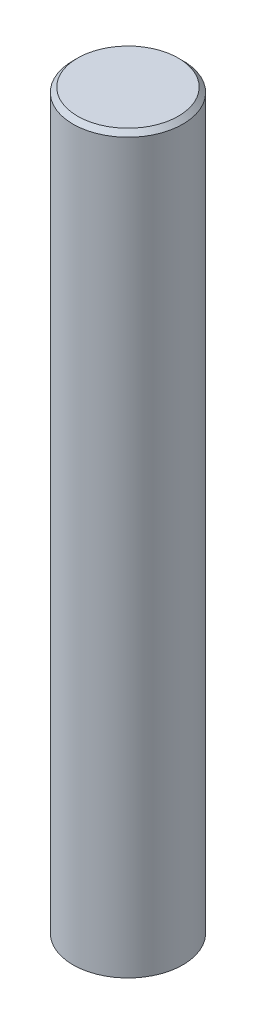
ISO-10303-21;
HEADER;
FILE_DESCRIPTION(('STEP AP214'),'2;1');
FILE_NAME('part.step','',(''),(''),'','','');
FILE_SCHEMA(('AUTOMOTIVE_DESIGN { 1 0 10303 214 1 1 1 1 }'));
ENDSEC;
DATA;
#1=APPLICATION_CONTEXT('core data for automotive mechanical design processes');
#2=APPLICATION_PROTOCOL_DEFINITION('international standard','automotive_design',2000,#1);
#3=PRODUCT_CONTEXT('',#1,'mechanical');
#4=PRODUCT('Part','Part','',(#3));
#5=PRODUCT_RELATED_PRODUCT_CATEGORY('part','',(#4));
#6=PRODUCT_DEFINITION_FORMATION('','',#4);
#7=PRODUCT_DEFINITION_CONTEXT('part definition',#1,'design');
#8=PRODUCT_DEFINITION('design','',#6,#7);
#9=PRODUCT_DEFINITION_SHAPE('','',#8);
#10=(LENGTH_UNIT() NAMED_UNIT(*) SI_UNIT(.MILLI.,.METRE.));
#11=(NAMED_UNIT(*) PLANE_ANGLE_UNIT() SI_UNIT($,.RADIAN.));
#12=(NAMED_UNIT(*) SI_UNIT($,.STERADIAN.) SOLID_ANGLE_UNIT());
#13=UNCERTAINTY_MEASURE_WITH_UNIT(LENGTH_MEASURE(1.E-05),#10,'distance_accuracy_value','');
#14=(GEOMETRIC_REPRESENTATION_CONTEXT(3) GLOBAL_UNCERTAINTY_ASSIGNED_CONTEXT((#13)) GLOBAL_UNIT_ASSIGNED_CONTEXT((#10,
#11,#12)) REPRESENTATION_CONTEXT('',''));
#15=CARTESIAN_POINT('',(0.,0.,0.));
#16=DIRECTION('',(0.,0.,1.));
#17=DIRECTION('',(1.,0.,0.));
#18=AXIS2_PLACEMENT_3D('',#15,#16,#17);
#19=CARTESIAN_POINT('',(0.,160.,0.));
#20=DIRECTION('',(0.,-1.,0.));
#21=DIRECTION('',(0.,0.,-1.));
#22=AXIS2_PLACEMENT_3D('',#19,#20,#21);
#23=CYLINDRICAL_SURFACE('',#22,12.);
#24=CARTESIAN_POINT('',(0.,159.,0.));
#25=DIRECTION('',(0.,1.,0.));
#26=DIRECTION('',(0.,0.,1.));
#27=AXIS2_PLACEMENT_3D('',#24,#25,#26);
#28=CIRCLE('',#27,12.);
#29=CARTESIAN_POINT('',(0.,159.,12.));
#30=VERTEX_POINT('',#29);
#31=EDGE_CURVE('E10',#30,#30,#28,.F.);
#32=ORIENTED_EDGE('',*,*,#31,.T.);
#33=EDGE_LOOP('',(#32));
#34=FACE_BOUND('',#33,.T.);
#35=CARTESIAN_POINT('',(0.,0.,0.));
#36=DIRECTION('',(0.,1.,0.));
#37=DIRECTION('',(0.,0.,1.));
#38=AXIS2_PLACEMENT_3D('',#35,#36,#37);
#39=CIRCLE('',#38,12.);
#40=CARTESIAN_POINT('',(0.,0.,12.));
#41=VERTEX_POINT('',#40);
#42=EDGE_CURVE('E42',#41,#41,#39,.T.);
#43=ORIENTED_EDGE('',*,*,#42,.T.);
#44=EDGE_LOOP('',(#43));
#45=FACE_BOUND('',#44,.T.);
#46=ADVANCED_FACE('F31',(#34,#45),#23,.T.);
#47=CARTESIAN_POINT('',(0.,160.,0.));
#48=DIRECTION('',(0.,1.,0.));
#49=DIRECTION('',(0.,0.,1.));
#50=AXIS2_PLACEMENT_3D('',#47,#48,#49);
#51=PLANE('',#50);
#52=CARTESIAN_POINT('',(0.,160.,0.));
#53=DIRECTION('',(0.,1.,0.));
#54=DIRECTION('',(0.,0.,1.));
#55=AXIS2_PLACEMENT_3D('',#52,#53,#54);
#56=CIRCLE('',#55,11.);
#57=CARTESIAN_POINT('',(0.,160.,11.));
#58=VERTEX_POINT('',#57);
#59=EDGE_CURVE('E38',#58,#58,#56,.T.);
#60=ORIENTED_EDGE('',*,*,#59,.T.);
#61=EDGE_LOOP('',(#60));
#62=FACE_BOUND('',#61,.T.);
#63=ADVANCED_FACE('F52',(#62),#51,.T.);
#64=CARTESIAN_POINT('',(0.,0.,0.));
#65=DIRECTION('',(0.,1.,0.));
#66=DIRECTION('',(0.,0.,1.));
#67=AXIS2_PLACEMENT_3D('',#64,#65,#66);
#68=PLANE('',#67);
#69=ORIENTED_EDGE('',*,*,#42,.F.);
#70=EDGE_LOOP('',(#69));
#71=FACE_BOUND('',#70,.T.);
#72=ADVANCED_FACE('F50',(#71),#68,.F.);
#73=CARTESIAN_POINT('',(0.,160.,0.));
#74=DIRECTION('',(0.,-1.,0.));
#75=DIRECTION('',(0.,0.,-1.));
#76=AXIS2_PLACEMENT_3D('',#73,#74,#75);
#77=CONICAL_SURFACE('',#76,11.,0.785398163397458);
#78=ORIENTED_EDGE('',*,*,#31,.F.);
#79=EDGE_LOOP('',(#78));
#80=FACE_BOUND('',#79,.T.);
#81=ORIENTED_EDGE('',*,*,#59,.F.);
#82=EDGE_LOOP('',(#81));
#83=FACE_BOUND('',#82,.T.);
#84=ADVANCED_FACE('F33',(#80,#83),#77,.T.);
#85=CLOSED_SHELL('',(#46,#63,#72,#84));
#86=MANIFOLD_SOLID_BREP('B2',#85);
#87=ADVANCED_BREP_SHAPE_REPRESENTATION('',(#18,#86),#14);
#88=SHAPE_DEFINITION_REPRESENTATION(#9,#87);
ENDSEC;
END-ISO-10303-21;
